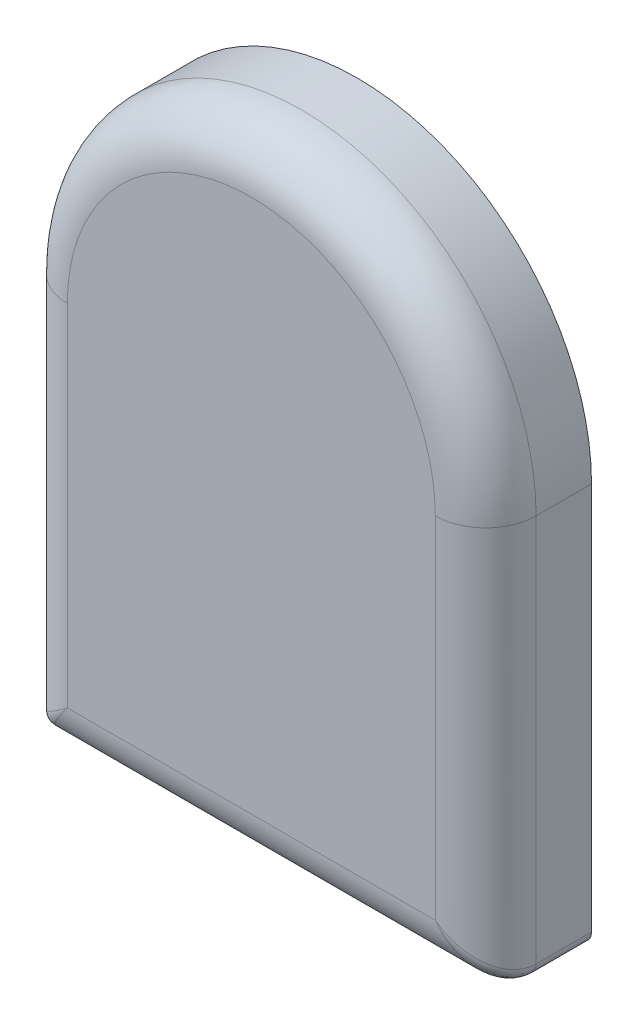
ISO-10303-21;
HEADER;
FILE_DESCRIPTION(('STEP AP214'),'2;1');
FILE_NAME('part.step','',(''),(''),'','','');
FILE_SCHEMA(('AUTOMOTIVE_DESIGN { 1 0 10303 214 1 1 1 1 }'));
ENDSEC;
DATA;
#1=APPLICATION_CONTEXT('core data for automotive mechanical design processes');
#2=APPLICATION_PROTOCOL_DEFINITION('international standard','automotive_design',2000,#1);
#3=PRODUCT_CONTEXT('',#1,'mechanical');
#4=PRODUCT('Part','Part','',(#3));
#5=PRODUCT_RELATED_PRODUCT_CATEGORY('part','',(#4));
#6=PRODUCT_DEFINITION_FORMATION('','',#4);
#7=PRODUCT_DEFINITION_CONTEXT('part definition',#1,'design');
#8=PRODUCT_DEFINITION('design','',#6,#7);
#9=PRODUCT_DEFINITION_SHAPE('','',#8);
#10=(LENGTH_UNIT() NAMED_UNIT(*) SI_UNIT(.MILLI.,.METRE.));
#11=(NAMED_UNIT(*) PLANE_ANGLE_UNIT() SI_UNIT($,.RADIAN.));
#12=(NAMED_UNIT(*) SI_UNIT($,.STERADIAN.) SOLID_ANGLE_UNIT());
#13=UNCERTAINTY_MEASURE_WITH_UNIT(LENGTH_MEASURE(1.E-05),#10,'distance_accuracy_value','');
#14=(GEOMETRIC_REPRESENTATION_CONTEXT(3) GLOBAL_UNCERTAINTY_ASSIGNED_CONTEXT((#13)) GLOBAL_UNIT_ASSIGNED_CONTEXT((#10,
#11,#12)) REPRESENTATION_CONTEXT('',''));
#15=CARTESIAN_POINT('',(0.,0.,0.));
#16=DIRECTION('',(0.,0.,1.));
#17=DIRECTION('',(1.,0.,0.));
#18=AXIS2_PLACEMENT_3D('',#15,#16,#17);
#19=CARTESIAN_POINT('',(8.8,-12.1,4.2));
#20=DIRECTION('',(0.,0.,-1.));
#21=DIRECTION('',(-1.,0.,0.));
#22=AXIS2_PLACEMENT_3D('',#19,#20,#21);
#23=CYLINDRICAL_SURFACE('',#22,0.5);
#24=DIRECTION('',(0.,0.,-1.));
#25=VECTOR('',#24,1.);
#26=CARTESIAN_POINT('',(9.3,-12.1,4.2));
#27=LINE('',#26,#25);
#28=CARTESIAN_POINT('',(9.3,-12.1,2.2));
#29=VERTEX_POINT('',#28);
#30=CARTESIAN_POINT('',(9.3,-12.1,0.));
#31=VERTEX_POINT('',#30);
#32=EDGE_CURVE('E109',#29,#31,#27,.T.);
#33=ORIENTED_EDGE('',*,*,#32,.F.);
#34=CARTESIAN_POINT('',(8.8,-12.1,2.2));
#35=DIRECTION('',(0.,0.,-1.));
#36=DIRECTION('',(-1.,0.,0.));
#37=AXIS2_PLACEMENT_3D('',#34,#35,#36);
#38=CIRCLE('',#37,0.5);
#39=CARTESIAN_POINT('',(8.8,-12.6,2.2));
#40=VERTEX_POINT('',#39);
#41=EDGE_CURVE('E185',#29,#40,#38,.T.);
#42=ORIENTED_EDGE('',*,*,#41,.T.);
#43=DIRECTION('',(0.,0.,-1.));
#44=VECTOR('',#43,1.);
#45=CARTESIAN_POINT('',(8.8,-12.6,4.2));
#46=LINE('',#45,#44);
#47=CARTESIAN_POINT('',(8.8,-12.6,0.));
#48=VERTEX_POINT('',#47);
#49=EDGE_CURVE('E135',#40,#48,#46,.T.);
#50=ORIENTED_EDGE('',*,*,#49,.T.);
#51=CARTESIAN_POINT('',(8.8,-12.1,0.));
#52=DIRECTION('',(0.,0.,1.));
#53=DIRECTION('',(1.,0.,0.));
#54=AXIS2_PLACEMENT_3D('',#51,#52,#53);
#55=CIRCLE('',#54,0.5);
#56=EDGE_CURVE('E128',#48,#31,#55,.T.);
#57=ORIENTED_EDGE('',*,*,#56,.T.);
#58=EDGE_LOOP('',(#33,#42,#50,#57));
#59=FACE_BOUND('',#58,.T.);
#60=ADVANCED_FACE('F43',(#59),#23,.T.);
#61=CARTESIAN_POINT('',(9.3,3.3,4.2));
#62=DIRECTION('',(-1.,0.,0.));
#63=DIRECTION('',(0.,0.,1.));
#64=AXIS2_PLACEMENT_3D('',#61,#62,#63);
#65=PLANE('',#64);
#66=DIRECTION('',(0.,0.,-1.));
#67=VECTOR('',#66,1.);
#68=CARTESIAN_POINT('',(9.3,3.3,4.2));
#69=LINE('',#68,#67);
#70=CARTESIAN_POINT('',(9.3,3.3,2.2));
#71=VERTEX_POINT('',#70);
#72=CARTESIAN_POINT('',(9.3,3.3,0.));
#73=VERTEX_POINT('',#72);
#74=EDGE_CURVE('E122',#71,#73,#69,.T.);
#75=ORIENTED_EDGE('',*,*,#74,.F.);
#76=DIRECTION('',(0.,1.,0.));
#77=VECTOR('',#76,1.);
#78=CARTESIAN_POINT('',(9.3,-12.1,2.2));
#79=LINE('',#78,#77);
#80=EDGE_CURVE('E116',#71,#29,#79,.F.);
#81=ORIENTED_EDGE('',*,*,#80,.T.);
#82=ORIENTED_EDGE('',*,*,#32,.T.);
#83=DIRECTION('',(0.,1.,0.));
#84=VECTOR('',#83,1.);
#85=CARTESIAN_POINT('',(9.3,3.3,0.));
#86=LINE('',#85,#84);
#87=EDGE_CURVE('E113',#31,#73,#86,.T.);
#88=ORIENTED_EDGE('',*,*,#87,.T.);
#89=EDGE_LOOP('',(#75,#81,#82,#88));
#90=FACE_BOUND('',#89,.T.);
#91=ADVANCED_FACE('F112',(#90),#65,.F.);
#92=CARTESIAN_POINT('',(0.,3.3,4.2));
#93=DIRECTION('',(0.,0.,-1.));
#94=DIRECTION('',(-1.,0.,0.));
#95=AXIS2_PLACEMENT_3D('',#92,#93,#94);
#96=CYLINDRICAL_SURFACE('',#95,9.3);
#97=DIRECTION('',(0.,0.,-1.));
#98=VECTOR('',#97,1.);
#99=CARTESIAN_POINT('',(-9.3,3.3,4.2));
#100=LINE('',#99,#98);
#101=CARTESIAN_POINT('',(-9.3,3.3,2.2));
#102=VERTEX_POINT('',#101);
#103=CARTESIAN_POINT('',(-9.3,3.3,0.));
#104=VERTEX_POINT('',#103);
#105=EDGE_CURVE('E164',#102,#104,#100,.T.);
#106=ORIENTED_EDGE('',*,*,#105,.F.);
#107=CARTESIAN_POINT('',(0.,3.3,2.2));
#108=DIRECTION('',(0.,0.,1.));
#109=DIRECTION('',(1.,0.,0.));
#110=AXIS2_PLACEMENT_3D('',#107,#108,#109);
#111=CIRCLE('',#110,9.3);
#112=EDGE_CURVE('E190',#102,#71,#111,.F.);
#113=ORIENTED_EDGE('',*,*,#112,.T.);
#114=ORIENTED_EDGE('',*,*,#74,.T.);
#115=CARTESIAN_POINT('',(0.,3.3,0.));
#116=DIRECTION('',(0.,0.,1.));
#117=DIRECTION('',(1.,0.,0.));
#118=AXIS2_PLACEMENT_3D('',#115,#116,#117);
#119=CIRCLE('',#118,9.3);
#120=EDGE_CURVE('E131',#73,#104,#119,.T.);
#121=ORIENTED_EDGE('',*,*,#120,.T.);
#122=EDGE_LOOP('',(#106,#113,#114,#121));
#123=FACE_BOUND('',#122,.T.);
#124=ADVANCED_FACE('F249',(#123),#96,.T.);
#125=CARTESIAN_POINT('',(-9.3,-12.1,4.2));
#126=DIRECTION('',(1.,0.,0.));
#127=DIRECTION('',(0.,1.,0.));
#128=AXIS2_PLACEMENT_3D('',#125,#126,#127);
#129=PLANE('',#128);
#130=DIRECTION('',(0.,0.,-1.));
#131=VECTOR('',#130,1.);
#132=CARTESIAN_POINT('',(-9.3,-12.1,4.2));
#133=LINE('',#132,#131);
#134=CARTESIAN_POINT('',(-9.3,-12.1,2.2));
#135=VERTEX_POINT('',#134);
#136=CARTESIAN_POINT('',(-9.3,-12.1,0.));
#137=VERTEX_POINT('',#136);
#138=EDGE_CURVE('E161',#135,#137,#133,.T.);
#139=ORIENTED_EDGE('',*,*,#138,.F.);
#140=DIRECTION('',(0.,-1.,0.));
#141=VECTOR('',#140,1.);
#142=CARTESIAN_POINT('',(-9.3,3.3,2.2));
#143=LINE('',#142,#141);
#144=EDGE_CURVE('E53',#135,#102,#143,.F.);
#145=ORIENTED_EDGE('',*,*,#144,.T.);
#146=ORIENTED_EDGE('',*,*,#105,.T.);
#147=DIRECTION('',(0.,-1.,0.));
#148=VECTOR('',#147,1.);
#149=CARTESIAN_POINT('',(-9.3,-12.1,0.));
#150=LINE('',#149,#148);
#151=EDGE_CURVE('E145',#104,#137,#150,.T.);
#152=ORIENTED_EDGE('',*,*,#151,.T.);
#153=EDGE_LOOP('',(#139,#145,#146,#152));
#154=FACE_BOUND('',#153,.T.);
#155=ADVANCED_FACE('F250',(#154),#129,.F.);
#156=CARTESIAN_POINT('',(-8.8,-12.1,4.2));
#157=DIRECTION('',(0.,0.,-1.));
#158=DIRECTION('',(-1.,0.,0.));
#159=AXIS2_PLACEMENT_3D('',#156,#157,#158);
#160=CYLINDRICAL_SURFACE('',#159,0.5);
#161=DIRECTION('',(0.,0.,-1.));
#162=VECTOR('',#161,1.);
#163=CARTESIAN_POINT('',(-8.8,-12.6,4.2));
#164=LINE('',#163,#162);
#165=CARTESIAN_POINT('',(-8.8,-12.6,2.2));
#166=VERTEX_POINT('',#165);
#167=CARTESIAN_POINT('',(-8.8,-12.6,0.));
#168=VERTEX_POINT('',#167);
#169=EDGE_CURVE('E158',#166,#168,#164,.T.);
#170=ORIENTED_EDGE('',*,*,#169,.F.);
#171=CARTESIAN_POINT('',(-8.8,-12.1,2.2));
#172=DIRECTION('',(0.,0.,-1.));
#173=DIRECTION('',(-1.,0.,0.));
#174=AXIS2_PLACEMENT_3D('',#171,#172,#173);
#175=CIRCLE('',#174,0.5);
#176=EDGE_CURVE('E11',#166,#135,#175,.T.);
#177=ORIENTED_EDGE('',*,*,#176,.T.);
#178=ORIENTED_EDGE('',*,*,#138,.T.);
#179=CARTESIAN_POINT('',(-8.8,-12.1,0.));
#180=DIRECTION('',(0.,0.,1.));
#181=DIRECTION('',(1.,0.,0.));
#182=AXIS2_PLACEMENT_3D('',#179,#180,#181);
#183=CIRCLE('',#182,0.5);
#184=EDGE_CURVE('E149',#137,#168,#183,.T.);
#185=ORIENTED_EDGE('',*,*,#184,.T.);
#186=EDGE_LOOP('',(#170,#177,#178,#185));
#187=FACE_BOUND('',#186,.T.);
#188=ADVANCED_FACE('F252',(#187),#160,.T.);
#189=CARTESIAN_POINT('',(8.8,-12.6,4.2));
#190=DIRECTION('',(0.,1.,0.));
#191=DIRECTION('',(0.,0.,1.));
#192=AXIS2_PLACEMENT_3D('',#189,#190,#191);
#193=PLANE('',#192);
#194=ORIENTED_EDGE('',*,*,#49,.F.);
#195=DIRECTION('',(1.,0.,0.));
#196=VECTOR('',#195,1.);
#197=CARTESIAN_POINT('',(-8.8,-12.6,2.2));
#198=LINE('',#197,#196);
#199=EDGE_CURVE('E181',#40,#166,#198,.F.);
#200=ORIENTED_EDGE('',*,*,#199,.T.);
#201=ORIENTED_EDGE('',*,*,#169,.T.);
#202=DIRECTION('',(1.,0.,0.));
#203=VECTOR('',#202,1.);
#204=CARTESIAN_POINT('',(8.8,-12.6,0.));
#205=LINE('',#204,#203);
#206=EDGE_CURVE('E153',#168,#48,#205,.T.);
#207=ORIENTED_EDGE('',*,*,#206,.T.);
#208=EDGE_LOOP('',(#194,#200,#201,#207));
#209=FACE_BOUND('',#208,.T.);
#210=ADVANCED_FACE('F254',(#209),#193,.F.);
#211=CARTESIAN_POINT('',(8.8,-12.1,4.2));
#212=DIRECTION('',(0.,0.,1.));
#213=DIRECTION('',(1.,0.,0.));
#214=AXIS2_PLACEMENT_3D('',#211,#212,#213);
#215=PLANE('',#214);
#216=DIRECTION('',(0.,-1.,0.));
#217=VECTOR('',#216,1.);
#218=CARTESIAN_POINT('',(-7.3,-12.1,4.2));
#219=LINE('',#218,#217);
#220=CARTESIAN_POINT('',(-7.3,3.3,4.2));
#221=VERTEX_POINT('',#220);
#222=CARTESIAN_POINT('',(-7.3,-10.6,4.2));
#223=VERTEX_POINT('',#222);
#224=EDGE_CURVE('E121',#221,#223,#219,.T.);
#225=ORIENTED_EDGE('',*,*,#224,.T.);
#226=DIRECTION('',(1.,0.,0.));
#227=VECTOR('',#226,1.);
#228=CARTESIAN_POINT('',(8.8,-10.6,4.2));
#229=LINE('',#228,#227);
#230=CARTESIAN_POINT('',(7.3,-10.6,4.2));
#231=VERTEX_POINT('',#230);
#232=EDGE_CURVE('E177',#223,#231,#229,.T.);
#233=ORIENTED_EDGE('',*,*,#232,.T.);
#234=DIRECTION('',(0.,1.,0.));
#235=VECTOR('',#234,1.);
#236=CARTESIAN_POINT('',(7.3,3.3,4.2));
#237=LINE('',#236,#235);
#238=CARTESIAN_POINT('',(7.3,3.3,4.2));
#239=VERTEX_POINT('',#238);
#240=EDGE_CURVE('E174',#231,#239,#237,.T.);
#241=ORIENTED_EDGE('',*,*,#240,.T.);
#242=CARTESIAN_POINT('',(0.,3.3,4.2));
#243=DIRECTION('',(0.,0.,1.));
#244=DIRECTION('',(1.,0.,0.));
#245=AXIS2_PLACEMENT_3D('',#242,#243,#244);
#246=CIRCLE('',#245,7.3);
#247=EDGE_CURVE('E171',#239,#221,#246,.T.);
#248=ORIENTED_EDGE('',*,*,#247,.T.);
#249=EDGE_LOOP('',(#225,#233,#241,#248));
#250=FACE_BOUND('',#249,.T.);
#251=ADVANCED_FACE('F260',(#250),#215,.T.);
#252=CARTESIAN_POINT('',(8.8,-12.1,0.));
#253=DIRECTION('',(0.,0.,1.));
#254=DIRECTION('',(1.,0.,0.));
#255=AXIS2_PLACEMENT_3D('',#252,#253,#254);
#256=PLANE('',#255);
#257=ORIENTED_EDGE('',*,*,#56,.F.);
#258=ORIENTED_EDGE('',*,*,#206,.F.);
#259=ORIENTED_EDGE('',*,*,#184,.F.);
#260=ORIENTED_EDGE('',*,*,#151,.F.);
#261=ORIENTED_EDGE('',*,*,#120,.F.);
#262=ORIENTED_EDGE('',*,*,#87,.F.);
#263=EDGE_LOOP('',(#257,#258,#259,#260,#261,#262));
#264=FACE_BOUND('',#263,.T.);
#265=ADVANCED_FACE('F126',(#264),#256,.F.);
#266=CARTESIAN_POINT('',(0.,3.3,2.2));
#267=DIRECTION('',(0.,0.,1.));
#268=DIRECTION('',(1.,0.,0.));
#269=AXIS2_PLACEMENT_3D('',#266,#267,#268);
#270=TOROIDAL_SURFACE('',#269,7.3,2.);
#271=CARTESIAN_POINT('',(7.3,3.3,2.2));
#272=DIRECTION('',(0.,-1.,0.));
#273=DIRECTION('',(0.,0.,-1.));
#274=AXIS2_PLACEMENT_3D('',#271,#272,#273);
#275=CIRCLE('',#274,2.);
#276=EDGE_CURVE('E141',#71,#239,#275,.T.);
#277=ORIENTED_EDGE('',*,*,#276,.F.);
#278=ORIENTED_EDGE('',*,*,#112,.F.);
#279=CARTESIAN_POINT('',(-7.3,3.3,2.2));
#280=DIRECTION('',(0.,-1.,0.));
#281=DIRECTION('',(1.,0.,0.));
#282=AXIS2_PLACEMENT_3D('',#279,#280,#281);
#283=CIRCLE('',#282,2.);
#284=EDGE_CURVE('E47',#221,#102,#283,.T.);
#285=ORIENTED_EDGE('',*,*,#284,.F.);
#286=ORIENTED_EDGE('',*,*,#247,.F.);
#287=EDGE_LOOP('',(#277,#278,#285,#286));
#288=FACE_BOUND('',#287,.T.);
#289=ADVANCED_FACE('F45',(#288),#270,.T.);
#290=CARTESIAN_POINT('',(-7.3,-12.1,2.2));
#291=DIRECTION('',(0.,1.,0.));
#292=DIRECTION('',(-1.,0.,0.));
#293=AXIS2_PLACEMENT_3D('',#290,#291,#292);
#294=CYLINDRICAL_SURFACE('',#293,2.);
#295=ORIENTED_EDGE('',*,*,#284,.T.);
#296=ORIENTED_EDGE('',*,*,#144,.F.);
#297=CARTESIAN_POINT('',(-7.3,-10.6,2.2));
#298=DIRECTION('',(0.6,-0.8,0.));
#299=DIRECTION('',(-0.8,-0.6,0.));
#300=AXIS2_PLACEMENT_3D('',#297,#298,#299);
#301=ELLIPSE('',#300,2.5,2.);
#302=EDGE_CURVE('E205',#223,#135,#301,.T.);
#303=ORIENTED_EDGE('',*,*,#302,.F.);
#304=ORIENTED_EDGE('',*,*,#224,.F.);
#305=EDGE_LOOP('',(#295,#296,#303,#304));
#306=FACE_BOUND('',#305,.T.);
#307=ADVANCED_FACE('F225',(#306),#294,.T.);
#308=CARTESIAN_POINT('',(7.3,-12.1,2.2));
#309=DIRECTION('',(0.,-1.,0.));
#310=DIRECTION('',(0.,0.,-1.));
#311=AXIS2_PLACEMENT_3D('',#308,#309,#310);
#312=CYLINDRICAL_SURFACE('',#311,2.);
#313=ORIENTED_EDGE('',*,*,#276,.T.);
#314=ORIENTED_EDGE('',*,*,#240,.F.);
#315=CARTESIAN_POINT('',(7.3,-10.6,2.2));
#316=DIRECTION('',(0.6,0.8,0.));
#317=DIRECTION('',(0.8,-0.6,0.));
#318=AXIS2_PLACEMENT_3D('',#315,#316,#317);
#319=ELLIPSE('',#318,2.5,2.);
#320=EDGE_CURVE('E201',#29,#231,#319,.F.);
#321=ORIENTED_EDGE('',*,*,#320,.F.);
#322=ORIENTED_EDGE('',*,*,#80,.F.);
#323=EDGE_LOOP('',(#313,#314,#321,#322));
#324=FACE_BOUND('',#323,.T.);
#325=ADVANCED_FACE('F221',(#324),#312,.T.);
#326=CARTESIAN_POINT('',(-7.3,-10.6,0.200000000000001));
#327=CARTESIAN_POINT('',(-7.3,-10.6,0.200000000000001));
#328=CARTESIAN_POINT('',(-7.3,-10.6,0.200000000000001));
#329=CARTESIAN_POINT('',(-7.36534712065569,-10.6871294942076,0.200035055250015));
#330=CARTESIAN_POINT('',(-7.37625301968526,-10.6762530196853,0.199976339095898));
#331=CARTESIAN_POINT('',(-7.38712949420759,-10.6653471206557,0.200035055250015));
#332=CARTESIAN_POINT('',(-7.43071092668624,-10.7742812355817,0.205696487430835));
#333=CARTESIAN_POINT('',(-7.45271669848803,-10.752716698488,0.204277360821934));
#334=CARTESIAN_POINT('',(-7.47428123558166,-10.7307109266862,0.205696487430835));
#335=CARTESIAN_POINT('',(-7.56031449090428,-10.9470859878724,0.228427051088899));
#336=CARTESIAN_POINT('',(-7.60446975212246,-10.9044697521225,0.22140059823371));
#337=CARTESIAN_POINT('',(-7.64708598787237,-10.8603144909043,0.228427051088899));
#338=CARTESIAN_POINT('',(-7.62455908096206,-11.0327454412827,0.245398809321809));
#339=CARTESIAN_POINT('',(-7.68019165762918,-10.9801916576292,0.234247025705178));
#340=CARTESIAN_POINT('',(-7.73274544128274,-10.9245590809621,0.245398809321809));
#341=CARTESIAN_POINT('',(-7.75083012894728,-11.2011068385964,0.290516308556291));
#342=CARTESIAN_POINT('',(-7.82973753195478,-11.1297375319548,0.268479521630331));
#343=CARTESIAN_POINT('',(-7.90110683859638,-11.0508301289473,0.290516308556291));
#344=CARTESIAN_POINT('',(-7.81287571744484,-11.2838342899265,0.318469854155509));
#345=CARTESIAN_POINT('',(-7.90398851452828,-11.2039885145283,0.289912895749702));
#346=CARTESIAN_POINT('',(-7.98383428992645,-11.1128757174448,0.318469854155509));
#347=CARTESIAN_POINT('',(-7.93366820048003,-11.4448909339734,0.385180085693134));
#348=CARTESIAN_POINT('',(-8.04991425185414,-11.3499142518541,0.341360606992456));
#349=CARTESIAN_POINT('',(-8.14489093397337,-11.23366820048,0.385180085693134));
#350=CARTESIAN_POINT('',(-7.99245870376998,-11.5232782716933,0.423653679114348));
#351=CARTESIAN_POINT('',(-8.12200143121126,-11.4220014312113,0.371441966476322));
#352=CARTESIAN_POINT('',(-8.22327827169331,-11.29245870377,0.423653679114348));
#353=CARTESIAN_POINT('',(-8.10570975300993,-11.6742796706799,0.510834776663723));
#354=CARTESIAN_POINT('',(-8.26295325731846,-11.5629532573185,0.440367062406523));
#355=CARTESIAN_POINT('',(-8.3742796706799,-11.4057097530099,0.510834776663724));
#356=CARTESIAN_POINT('',(-8.1602485580067,-11.7469980773423,0.559177555106217));
#357=CARTESIAN_POINT('',(-8.33220337416109,-11.6322033741611,0.479288917524901));
#358=CARTESIAN_POINT('',(-8.44699807734226,-11.4602485580067,0.559177555106218));
#359=CARTESIAN_POINT('',(-8.26402611496821,-11.8853681532909,0.665353034789945));
#360=CARTESIAN_POINT('',(-8.46682192510474,-11.7668219251047,0.566297856684954));
#361=CARTESIAN_POINT('',(-8.58536815329094,-11.5640261149682,0.665353034789946));
#362=CARTESIAN_POINT('',(-8.31338750743845,-11.9511833432513,0.722755397155792));
#363=CARTESIAN_POINT('',(-8.53252990498461,-11.8325299049846,0.614455680376174));
#364=CARTESIAN_POINT('',(-8.65118334325127,-11.6133875074385,0.722755397155792));
#365=CARTESIAN_POINT('',(-8.40591892041319,-12.0745585605509,0.846132222162794));
#366=CARTESIAN_POINT('',(-8.65927843911775,-11.9592784391177,0.72064706325371));
#367=CARTESIAN_POINT('',(-8.77455856055092,-11.7059189204132,0.846132222162793));
#368=CARTESIAN_POINT('',(-8.44926311849199,-12.132350824656,0.911637313282867));
#369=CARTESIAN_POINT('',(-8.72058796060971,-12.0205879606097,0.77870927589382));
#370=CARTESIAN_POINT('',(-8.83235082465598,-11.749263118492,0.911637313282867));
#371=CARTESIAN_POINT('',(-8.52896450999682,-12.2386193466624,1.05013285836796));
#372=CARTESIAN_POINT('',(-8.83742230607737,-12.1374223060774,0.905718655842486));
#373=CARTESIAN_POINT('',(-8.93861934666242,-11.8289645099968,1.05013285836796));
#374=CARTESIAN_POINT('',(-8.56554818620167,-12.2873975816022,1.12265451812362));
#375=CARTESIAN_POINT('',(-8.893119014594,-12.193119014594,0.974594782404193));
#376=CARTESIAN_POINT('',(-8.98739758160222,-11.8655481862017,1.12265451812362));
#377=CARTESIAN_POINT('',(-8.63104897214961,-12.3747319628661,1.27392958631864));
#378=CARTESIAN_POINT('',(-8.99700237456934,-12.2970023745693,1.12428825163707));
#379=CARTESIAN_POINT('',(-9.07473196286614,-11.9310489721496,1.27392958631864));
#380=CARTESIAN_POINT('',(-8.66023331373321,-12.4136444183109,1.35226632370846));
#381=CARTESIAN_POINT('',(-9.04524564728287,-12.3452456472829,1.20485256451251));
#382=CARTESIAN_POINT('',(-9.11364441831094,-11.9602333137332,1.35226632370846));
#383=CARTESIAN_POINT('',(-8.71039789563343,-12.4805305275112,1.51375694675793));
#384=CARTESIAN_POINT('',(-9.13168487740083,-12.4316848774008,1.37835057694996));
#385=CARTESIAN_POINT('',(-9.18053052751125,-12.0103978956334,1.51375694675793));
#386=CARTESIAN_POINT('',(-8.73165591145982,-12.5088745486131,1.59659973042092));
#387=CARTESIAN_POINT('',(-9.16982930810949,-12.4698293081095,1.47075659896622));
#388=CARTESIAN_POINT('',(-9.20887454861309,-12.0316559114598,1.59659973042092));
#389=CARTESIAN_POINT('',(-8.76560412617006,-12.5541388348934,1.76554895244281));
#390=CARTESIAN_POINT('',(-9.23291592445389,-12.5329159244539,1.6666663568643));
#391=CARTESIAN_POINT('',(-9.25413883489341,-12.0656041261701,1.76554895244281));
#392=CARTESIAN_POINT('',(-8.7785324204649,-12.5713765606199,1.85148270452044));
#393=CARTESIAN_POINT('',(-9.25774658379329,-12.5577465837933,1.76930869505542));
#394=CARTESIAN_POINT('',(-9.27137656061987,-12.0785324204649,1.85148270452044));
#395=CARTESIAN_POINT('',(-8.79566049473916,-12.5942139929855,2.0249775244552));
#396=CARTESIAN_POINT('',(-9.29133353940984,-12.5913335394098,1.98185786072974));
#397=CARTESIAN_POINT('',(-9.29421399298555,-12.0956604947392,2.0249775244552));
#398=CARTESIAN_POINT('',(-8.8,-12.6,2.1124887622276));
#399=CARTESIAN_POINT('',(-9.3,-12.6,2.0906106505444));
#400=CARTESIAN_POINT('',(-9.3,-12.1,2.1124887622276));
#401=CARTESIAN_POINT('',(-8.8,-12.6,2.2875112377724));
#402=CARTESIAN_POINT('',(-9.3,-12.6,2.30938934945561));
#403=CARTESIAN_POINT('',(-9.3,-12.1,2.2875112377724));
#404=CARTESIAN_POINT('',(-8.79566049473916,-12.5942139929855,2.37502247554481));
#405=CARTESIAN_POINT('',(-9.29133353940984,-12.5913335394098,2.41814213927026));
#406=CARTESIAN_POINT('',(-9.29421399298555,-12.0956604947392,2.37502247554481));
#407=CARTESIAN_POINT('',(-8.7785324204649,-12.5713765606199,2.54851729547956));
#408=CARTESIAN_POINT('',(-9.25774658379329,-12.5577465837933,2.63069130494458));
#409=CARTESIAN_POINT('',(-9.27137656061987,-12.0785324204649,2.54851729547956));
#410=CARTESIAN_POINT('',(-8.76560412617006,-12.5541388348934,2.63445104755719));
#411=CARTESIAN_POINT('',(-9.23291592445389,-12.5329159244539,2.7333336431357));
#412=CARTESIAN_POINT('',(-9.25413883489341,-12.0656041261701,2.63445104755719));
#413=CARTESIAN_POINT('',(-8.73165591145982,-12.5088745486131,2.80340026957908));
#414=CARTESIAN_POINT('',(-9.16982930810949,-12.4698293081095,2.92924340103378));
#415=CARTESIAN_POINT('',(-9.20887454861309,-12.0316559114598,2.80340026957908));
#416=CARTESIAN_POINT('',(-8.71039789563343,-12.4805305275113,2.88624305324207));
#417=CARTESIAN_POINT('',(-9.13168487740083,-12.4316848774008,3.02164942305004));
#418=CARTESIAN_POINT('',(-9.18053052751125,-12.0103978956334,2.88624305324207));
#419=CARTESIAN_POINT('',(-8.66023331373321,-12.4136444183109,3.04773367629154));
#420=CARTESIAN_POINT('',(-9.04524564728287,-12.3452456472829,3.19514743548749));
#421=CARTESIAN_POINT('',(-9.11364441831094,-11.9602333137332,3.04773367629154));
#422=CARTESIAN_POINT('',(-8.63104897214961,-12.3747319628661,3.12607041368136));
#423=CARTESIAN_POINT('',(-8.99700237456934,-12.2970023745693,3.27571174836293));
#424=CARTESIAN_POINT('',(-9.07473196286614,-11.9310489721496,3.12607041368136));
#425=CARTESIAN_POINT('',(-8.56554818620167,-12.2873975816022,3.27734548187638));
#426=CARTESIAN_POINT('',(-8.893119014594,-12.193119014594,3.42540521759581));
#427=CARTESIAN_POINT('',(-8.98739758160222,-11.8655481862017,3.27734548187638));
#428=CARTESIAN_POINT('',(-8.52896450999682,-12.2386193466624,3.34986714163205));
#429=CARTESIAN_POINT('',(-8.83742230607737,-12.1374223060774,3.49428134415751));
#430=CARTESIAN_POINT('',(-8.93861934666242,-11.8289645099968,3.34986714163205));
#431=CARTESIAN_POINT('',(-8.44926311849199,-12.132350824656,3.48836268671713));
#432=CARTESIAN_POINT('',(-8.72058796060971,-12.0205879606097,3.62129072410618));
#433=CARTESIAN_POINT('',(-8.83235082465598,-11.749263118492,3.48836268671713));
#434=CARTESIAN_POINT('',(-8.40591892041319,-12.0745585605509,3.55386777783721));
#435=CARTESIAN_POINT('',(-8.65927843911775,-11.9592784391177,3.67935293674629));
#436=CARTESIAN_POINT('',(-8.77455856055092,-11.7059189204132,3.55386777783721));
#437=CARTESIAN_POINT('',(-8.31338750743845,-11.9511833432513,3.67724460284421));
#438=CARTESIAN_POINT('',(-8.53252990498461,-11.8325299049846,3.78554431962383));
#439=CARTESIAN_POINT('',(-8.65118334325127,-11.6133875074385,3.67724460284421));
#440=CARTESIAN_POINT('',(-8.26402611496821,-11.8853681532909,3.73464696521006));
#441=CARTESIAN_POINT('',(-8.46682192510474,-11.7668219251047,3.83370214331505));
#442=CARTESIAN_POINT('',(-8.58536815329094,-11.5640261149682,3.73464696521006));
#443=CARTESIAN_POINT('',(-8.1602485580067,-11.7469980773423,3.84082244489378));
#444=CARTESIAN_POINT('',(-8.33220337416109,-11.6322033741611,3.9207110824751));
#445=CARTESIAN_POINT('',(-8.44699807734226,-11.4602485580067,3.84082244489378));
#446=CARTESIAN_POINT('',(-8.10570975300993,-11.6742796706799,3.88916522333628));
#447=CARTESIAN_POINT('',(-8.26295325731846,-11.5629532573185,3.95963293759348));
#448=CARTESIAN_POINT('',(-8.3742796706799,-11.4057097530099,3.88916522333628));
#449=CARTESIAN_POINT('',(-7.99245870376998,-11.5232782716933,3.97634632088565));
#450=CARTESIAN_POINT('',(-8.12200143121126,-11.4220014312113,4.02855803352368));
#451=CARTESIAN_POINT('',(-8.22327827169331,-11.29245870377,3.97634632088565));
#452=CARTESIAN_POINT('',(-7.93366820048003,-11.4448909339734,4.01481991430687));
#453=CARTESIAN_POINT('',(-8.04991425185414,-11.3499142518541,4.05863939300755));
#454=CARTESIAN_POINT('',(-8.14489093397337,-11.23366820048,4.01481991430687));
#455=CARTESIAN_POINT('',(-7.81287571744484,-11.2838342899265,4.08153014584449));
#456=CARTESIAN_POINT('',(-7.90398851452829,-11.2039885145283,4.1100871042503));
#457=CARTESIAN_POINT('',(-7.98383428992646,-11.1128757174448,4.08153014584449));
#458=CARTESIAN_POINT('',(-7.75083012894728,-11.2011068385964,4.10948369144371));
#459=CARTESIAN_POINT('',(-7.82973753195478,-11.1297375319548,4.13152047836967));
#460=CARTESIAN_POINT('',(-7.90110683859638,-11.0508301289473,4.10948369144371));
#461=CARTESIAN_POINT('',(-7.62455908096206,-11.0327454412827,4.15460119067819));
#462=CARTESIAN_POINT('',(-7.68019165762918,-10.9801916576292,4.16575297429482));
#463=CARTESIAN_POINT('',(-7.73274544128274,-10.9245590809621,4.15460119067819));
#464=CARTESIAN_POINT('',(-7.56031449090428,-10.9470859878724,4.1715729489111));
#465=CARTESIAN_POINT('',(-7.60446975212246,-10.9044697521225,4.17859940176629));
#466=CARTESIAN_POINT('',(-7.64708598787237,-10.8603144909043,4.1715729489111));
#467=CARTESIAN_POINT('',(-7.43071092668624,-10.7742812355817,4.19430351256917));
#468=CARTESIAN_POINT('',(-7.45271669848803,-10.752716698488,4.19572263917807));
#469=CARTESIAN_POINT('',(-7.47428123558166,-10.7307109266862,4.19430351256917));
#470=CARTESIAN_POINT('',(-7.3653471206557,-10.6871294942076,4.19996494474999));
#471=CARTESIAN_POINT('',(-7.37625301968526,-10.6762530196853,4.2000236609041));
#472=CARTESIAN_POINT('',(-7.38712949420759,-10.6653471206557,4.19996494474999));
#473=CARTESIAN_POINT('',(-7.3,-10.6,4.2));
#474=CARTESIAN_POINT('',(-7.3,-10.6,4.2));
#475=CARTESIAN_POINT('',(-7.3,-10.6,4.2));
#476=(BOUNDED_SURFACE() B_SPLINE_SURFACE(3,2,((#326,#327,#328),(#329,#330,#331),(#332,#333,
#334),(#335,#336,#337),(#338,#339,#340),(#341,#342,#343),(#344,#345,#346),(#347,#348,#349),
(#350,#351,#352),(#353,#354,#355),(#356,#357,#358),(#359,#360,#361),(#362,#363,#364),(#365,#366,
#367),(#368,#369,#370),(#371,#372,#373),(#374,#375,#376),(#377,#378,#379),(#380,#381,#382),
(#383,#384,#385),(#386,#387,#388),(#389,#390,#391),(#392,#393,#394),(#395,#396,#397),(#398,#399,
#400),(#401,#402,#403),(#404,#405,#406),(#407,#408,#409),(#410,#411,#412),(#413,#414,#415),
(#416,#417,#418),(#419,#420,#421),(#422,#423,#424),(#425,#426,#427),(#428,#429,#430),(#431,#432,
#433),(#434,#435,#436),(#437,#438,#439),(#440,#441,#442),(#443,#444,#445),(#446,#447,#448),
(#449,#450,#451),(#452,#453,#454),(#455,#456,#457),(#458,#459,#460),(#461,#462,#463),(#464,#465,
#466),(#467,#468,#469),(#470,#471,#472),(#473,#474,#475)),.UNSPECIFIED.,.F.,.F.,
.F.) B_SPLINE_SURFACE_WITH_KNOTS((4,2,2,2,2,2,2,2,2,2,2,2,2,2,2,2,2,2,2,2,2,2,2,2,4),(3,3),(0.,
0.277185081205051,0.552014119053092,0.822233461976019,1.08579611517548,1.34096955189626,
1.58644804888033,1.82146864153553,2.04592551633704,2.26046944958155,2.4665662185127,
2.66647462606246,2.86310321556792,3.05973180507339,3.25964021262314,3.46573698155429,
3.6802809147988,3.90473778960032,4.13975838225551,4.38523687923959,4.64041031596037,
4.90397296915983,5.17419231208275,5.44902134993079,5.72620643113585),(0.,1.),
.UNSPECIFIED.) GEOMETRIC_REPRESENTATION_ITEM() RATIONAL_B_SPLINE_SURFACE(((1.,1.,1.),(1.,
1.00000566557019,1.),(1.,0.998576699090688,1.),(1.,0.992910721279765,1.),(1.,0.988697681267574,
1.),(1.,0.97761712883305,1.),(1.,0.970795325018433,1.),(1.,0.954789124900482,1.),(1.,
0.945667069465631,1.),(1.,0.92548796875733,1.),(1.,0.914501756375306,1.),(1.,0.891169998194024,
1.),(1.,0.878891956959708,1.),(1.,0.853706993048538,1.),(1.,0.84084914596985,1.),(1.,
0.815387454422431,1.),(1.,0.802798170091792,1.),(1.,0.778880732263429,1.),(1.,0.767521437046521,
1.),(1.,0.747118526989836,1.),(1.,0.738001346912332,1.),(1.,0.723039691293395,1.),(1.,
0.717105167896984,1.),(1.,0.709170186451793,1.),(1.,0.707106781186548,1.),(1.,0.707106781186548,
1.),(1.,0.709170186451793,1.),(1.,0.717105167896984,1.),(1.,0.723039691293395,1.),(1.,
0.738001346912332,1.),(1.,0.747118526989835,1.),(1.,0.767521437046521,1.),(1.,0.778880732263429,
1.),(1.,0.802798170091792,1.),(1.,0.815387454422431,1.),(1.,0.84084914596985,1.),(1.,
0.853706993048538,1.),(1.,0.878891956959708,1.),(1.,0.891169998194024,1.),(1.,0.914501756375306,
1.),(1.,0.92548796875733,1.),(1.,0.945667069465631,1.),(1.,0.954789124900482,1.),(1.,
0.970795325018433,1.),(1.,0.97761712883305,1.),(1.,0.988697681267574,1.),(1.,0.992910721279765,
1.),(1.,0.998576699090688,1.),(1.,1.00000566557019,1.),(1.,1.,1.))) REPRESENTATION_ITEM('') SURFACE());
#477=ORIENTED_EDGE('',*,*,#302,.T.);
#478=ORIENTED_EDGE('',*,*,#176,.F.);
#479=CARTESIAN_POINT('',(-7.3,-10.6,2.2));
#480=DIRECTION('',(0.8,-0.6,0.));
#481=DIRECTION('',(-0.6,-0.8,0.));
#482=AXIS2_PLACEMENT_3D('',#479,#480,#481);
#483=ELLIPSE('',#482,2.5,2.);
#484=EDGE_CURVE('E198',#223,#166,#483,.T.);
#485=ORIENTED_EDGE('',*,*,#484,.F.);
#486=EDGE_LOOP('',(#477,#478,#485));
#487=FACE_BOUND('',#486,.T.);
#488=ADVANCED_FACE('F217',(#487),#476,.T.);
#489=CARTESIAN_POINT('',(7.3,-10.6,0.200000000000001));
#490=CARTESIAN_POINT('',(7.3,-10.6,0.200000000000001));
#491=CARTESIAN_POINT('',(7.3,-10.6,0.200000000000001));
#492=CARTESIAN_POINT('',(7.38712949420759,-10.6653471206557,0.200035055250015));
#493=CARTESIAN_POINT('',(7.37625301968526,-10.6762530196853,0.199976339095899));
#494=CARTESIAN_POINT('',(7.3653471206557,-10.6871294942076,0.200035055250015));
#495=CARTESIAN_POINT('',(7.47428123558166,-10.7307109266862,0.205696487430835));
#496=CARTESIAN_POINT('',(7.45271669848803,-10.752716698488,0.204277360821935));
#497=CARTESIAN_POINT('',(7.43071092668625,-10.7742812355817,0.205696487430835));
#498=CARTESIAN_POINT('',(7.64708598787237,-10.8603144909043,0.228427051088899));
#499=CARTESIAN_POINT('',(7.60446975212246,-10.9044697521225,0.22140059823371));
#500=CARTESIAN_POINT('',(7.56031449090428,-10.9470859878724,0.228427051088899));
#501=CARTESIAN_POINT('',(7.73274544128274,-10.9245590809621,0.245398809321809));
#502=CARTESIAN_POINT('',(7.68019165762918,-10.9801916576292,0.234247025705178));
#503=CARTESIAN_POINT('',(7.62455908096206,-11.0327454412827,0.245398809321809));
#504=CARTESIAN_POINT('',(7.90110683859638,-11.0508301289473,0.290516308556291));
#505=CARTESIAN_POINT('',(7.82973753195478,-11.1297375319548,0.268479521630331));
#506=CARTESIAN_POINT('',(7.75083012894728,-11.2011068385964,0.290516308556291));
#507=CARTESIAN_POINT('',(7.98383428992646,-11.1128757174448,0.318469854155509));
#508=CARTESIAN_POINT('',(7.90398851452829,-11.2039885145283,0.289912895749702));
#509=CARTESIAN_POINT('',(7.81287571744484,-11.2838342899265,0.318469854155509));
#510=CARTESIAN_POINT('',(8.14489093397337,-11.23366820048,0.385180085693134));
#511=CARTESIAN_POINT('',(8.04991425185414,-11.3499142518541,0.341360606992456));
#512=CARTESIAN_POINT('',(7.93366820048003,-11.4448909339734,0.385180085693134));
#513=CARTESIAN_POINT('',(8.22327827169331,-11.29245870377,0.423653679114348));
#514=CARTESIAN_POINT('',(8.12200143121127,-11.4220014312113,0.371441966476322));
#515=CARTESIAN_POINT('',(7.99245870376998,-11.5232782716933,0.423653679114348));
#516=CARTESIAN_POINT('',(8.3742796706799,-11.4057097530099,0.510834776663724));
#517=CARTESIAN_POINT('',(8.26295325731846,-11.5629532573185,0.440367062406523));
#518=CARTESIAN_POINT('',(8.10570975300993,-11.6742796706799,0.510834776663724));
#519=CARTESIAN_POINT('',(8.44699807734226,-11.4602485580067,0.559177555106217));
#520=CARTESIAN_POINT('',(8.33220337416109,-11.6322033741611,0.479288917524901));
#521=CARTESIAN_POINT('',(8.1602485580067,-11.7469980773423,0.559177555106217));
#522=CARTESIAN_POINT('',(8.58536815329094,-11.5640261149682,0.665353034789945));
#523=CARTESIAN_POINT('',(8.46682192510474,-11.7668219251047,0.566297856684954));
#524=CARTESIAN_POINT('',(8.26402611496821,-11.8853681532909,0.665353034789945));
#525=CARTESIAN_POINT('',(8.65118334325127,-11.6133875074385,0.722755397155792));
#526=CARTESIAN_POINT('',(8.53252990498461,-11.8325299049846,0.614455680376174));
#527=CARTESIAN_POINT('',(8.31338750743845,-11.9511833432513,0.722755397155792));
#528=CARTESIAN_POINT('',(8.77455856055092,-11.7059189204132,0.846132222162794));
#529=CARTESIAN_POINT('',(8.65927843911775,-11.9592784391178,0.72064706325371));
#530=CARTESIAN_POINT('',(8.40591892041319,-12.0745585605509,0.846132222162794));
#531=CARTESIAN_POINT('',(8.83235082465598,-11.749263118492,0.911637313282867));
#532=CARTESIAN_POINT('',(8.72058796060972,-12.0205879606097,0.77870927589382));
#533=CARTESIAN_POINT('',(8.44926311849199,-12.132350824656,0.911637313282867));
#534=CARTESIAN_POINT('',(8.93861934666242,-11.8289645099968,1.05013285836796));
#535=CARTESIAN_POINT('',(8.83742230607737,-12.1374223060774,0.905718655842486));
#536=CARTESIAN_POINT('',(8.52896450999682,-12.2386193466624,1.05013285836796));
#537=CARTESIAN_POINT('',(8.98739758160223,-11.8655481862017,1.12265451812362));
#538=CARTESIAN_POINT('',(8.893119014594,-12.193119014594,0.974594782404194));
#539=CARTESIAN_POINT('',(8.56554818620167,-12.2873975816022,1.12265451812362));
#540=CARTESIAN_POINT('',(9.07473196286614,-11.9310489721496,1.27392958631864));
#541=CARTESIAN_POINT('',(8.99700237456934,-12.2970023745693,1.12428825163707));
#542=CARTESIAN_POINT('',(8.63104897214961,-12.3747319628661,1.27392958631864));
#543=CARTESIAN_POINT('',(9.11364441831095,-11.9602333137332,1.35226632370846));
#544=CARTESIAN_POINT('',(9.04524564728287,-12.3452456472829,1.20485256451251));
#545=CARTESIAN_POINT('',(8.66023331373321,-12.4136444183109,1.35226632370846));
#546=CARTESIAN_POINT('',(9.18053052751125,-12.0103978956334,1.51375694675793));
#547=CARTESIAN_POINT('',(9.13168487740083,-12.4316848774008,1.37835057694997));
#548=CARTESIAN_POINT('',(8.71039789563344,-12.4805305275112,1.51375694675793));
#549=CARTESIAN_POINT('',(9.2088745486131,-12.0316559114598,1.59659973042092));
#550=CARTESIAN_POINT('',(9.16982930810949,-12.4698293081095,1.47075659896622));
#551=CARTESIAN_POINT('',(8.73165591145982,-12.5088745486131,1.59659973042092));
#552=CARTESIAN_POINT('',(9.25413883489341,-12.0656041261701,1.76554895244281));
#553=CARTESIAN_POINT('',(9.23291592445389,-12.5329159244539,1.6666663568643));
#554=CARTESIAN_POINT('',(8.76560412617006,-12.5541388348934,1.76554895244281));
#555=CARTESIAN_POINT('',(9.27137656061987,-12.0785324204649,1.85148270452044));
#556=CARTESIAN_POINT('',(9.25774658379329,-12.5577465837933,1.76930869505542));
#557=CARTESIAN_POINT('',(8.77853242046491,-12.5713765606199,1.85148270452044));
#558=CARTESIAN_POINT('',(9.29421399298555,-12.0956604947392,2.0249775244552));
#559=CARTESIAN_POINT('',(9.29133353940984,-12.5913335394098,1.98185786072974));
#560=CARTESIAN_POINT('',(8.79566049473916,-12.5942139929855,2.0249775244552));
#561=CARTESIAN_POINT('',(9.3,-12.1,2.1124887622276));
#562=CARTESIAN_POINT('',(9.3,-12.6,2.0906106505444));
#563=CARTESIAN_POINT('',(8.8,-12.6,2.1124887622276));
#564=CARTESIAN_POINT('',(9.3,-12.1,2.2875112377724));
#565=CARTESIAN_POINT('',(9.3,-12.6,2.30938934945561));
#566=CARTESIAN_POINT('',(8.8,-12.6,2.2875112377724));
#567=CARTESIAN_POINT('',(9.29421399298555,-12.0956604947392,2.37502247554481));
#568=CARTESIAN_POINT('',(9.29133353940984,-12.5913335394098,2.41814213927026));
#569=CARTESIAN_POINT('',(8.79566049473916,-12.5942139929855,2.37502247554481));
#570=CARTESIAN_POINT('',(9.27137656061987,-12.0785324204649,2.54851729547956));
#571=CARTESIAN_POINT('',(9.25774658379329,-12.5577465837933,2.63069130494458));
#572=CARTESIAN_POINT('',(8.77853242046491,-12.5713765606199,2.54851729547956));
#573=CARTESIAN_POINT('',(9.25413883489341,-12.0656041261701,2.63445104755719));
#574=CARTESIAN_POINT('',(9.23291592445389,-12.5329159244539,2.7333336431357));
#575=CARTESIAN_POINT('',(8.76560412617006,-12.5541388348934,2.63445104755719));
#576=CARTESIAN_POINT('',(9.2088745486131,-12.0316559114598,2.80340026957908));
#577=CARTESIAN_POINT('',(9.1698293081095,-12.4698293081095,2.92924340103378));
#578=CARTESIAN_POINT('',(8.73165591145982,-12.5088745486131,2.80340026957908));
#579=CARTESIAN_POINT('',(9.18053052751125,-12.0103978956334,2.88624305324207));
#580=CARTESIAN_POINT('',(9.13168487740083,-12.4316848774008,3.02164942305004));
#581=CARTESIAN_POINT('',(8.71039789563344,-12.4805305275113,2.88624305324207));
#582=CARTESIAN_POINT('',(9.11364441831095,-11.9602333137332,3.04773367629154));
#583=CARTESIAN_POINT('',(9.04524564728287,-12.3452456472829,3.19514743548749));
#584=CARTESIAN_POINT('',(8.66023331373321,-12.4136444183109,3.04773367629154));
#585=CARTESIAN_POINT('',(9.07473196286614,-11.9310489721496,3.12607041368136));
#586=CARTESIAN_POINT('',(8.99700237456934,-12.2970023745693,3.27571174836293));
#587=CARTESIAN_POINT('',(8.63104897214961,-12.3747319628661,3.12607041368136));
#588=CARTESIAN_POINT('',(8.98739758160223,-11.8655481862017,3.27734548187638));
#589=CARTESIAN_POINT('',(8.893119014594,-12.193119014594,3.42540521759581));
#590=CARTESIAN_POINT('',(8.56554818620167,-12.2873975816022,3.27734548187638));
#591=CARTESIAN_POINT('',(8.93861934666242,-11.8289645099968,3.34986714163205));
#592=CARTESIAN_POINT('',(8.83742230607736,-12.1374223060774,3.49428134415751));
#593=CARTESIAN_POINT('',(8.52896450999682,-12.2386193466624,3.34986714163205));
#594=CARTESIAN_POINT('',(8.83235082465598,-11.749263118492,3.48836268671713));
#595=CARTESIAN_POINT('',(8.72058796060972,-12.0205879606097,3.62129072410618));
#596=CARTESIAN_POINT('',(8.44926311849199,-12.132350824656,3.48836268671713));
#597=CARTESIAN_POINT('',(8.77455856055092,-11.7059189204132,3.55386777783721));
#598=CARTESIAN_POINT('',(8.65927843911775,-11.9592784391177,3.67935293674629));
#599=CARTESIAN_POINT('',(8.40591892041319,-12.0745585605509,3.55386777783721));
#600=CARTESIAN_POINT('',(8.65118334325127,-11.6133875074385,3.67724460284421));
#601=CARTESIAN_POINT('',(8.53252990498462,-11.8325299049846,3.78554431962383));
#602=CARTESIAN_POINT('',(8.31338750743846,-11.9511833432513,3.67724460284421));
#603=CARTESIAN_POINT('',(8.58536815329094,-11.5640261149682,3.73464696521005));
#604=CARTESIAN_POINT('',(8.46682192510474,-11.7668219251047,3.83370214331505));
#605=CARTESIAN_POINT('',(8.26402611496821,-11.8853681532909,3.73464696521005));
#606=CARTESIAN_POINT('',(8.44699807734226,-11.4602485580067,3.84082244489378));
#607=CARTESIAN_POINT('',(8.33220337416109,-11.6322033741611,3.9207110824751));
#608=CARTESIAN_POINT('',(8.1602485580067,-11.7469980773423,3.84082244489378));
#609=CARTESIAN_POINT('',(8.3742796706799,-11.4057097530099,3.88916522333628));
#610=CARTESIAN_POINT('',(8.26295325731846,-11.5629532573185,3.95963293759348));
#611=CARTESIAN_POINT('',(8.10570975300993,-11.6742796706799,3.88916522333628));
#612=CARTESIAN_POINT('',(8.22327827169332,-11.29245870377,3.97634632088565));
#613=CARTESIAN_POINT('',(8.12200143121127,-11.4220014312113,4.02855803352368));
#614=CARTESIAN_POINT('',(7.99245870376999,-11.5232782716933,3.97634632088565));
#615=CARTESIAN_POINT('',(8.14489093397337,-11.23366820048,4.01481991430687));
#616=CARTESIAN_POINT('',(8.04991425185414,-11.3499142518541,4.05863939300755));
#617=CARTESIAN_POINT('',(7.93366820048003,-11.4448909339734,4.01481991430687));
#618=CARTESIAN_POINT('',(7.98383428992646,-11.1128757174448,4.08153014584449));
#619=CARTESIAN_POINT('',(7.90398851452829,-11.2039885145283,4.1100871042503));
#620=CARTESIAN_POINT('',(7.81287571744484,-11.2838342899265,4.08153014584449));
#621=CARTESIAN_POINT('',(7.90110683859638,-11.0508301289473,4.10948369144371));
#622=CARTESIAN_POINT('',(7.82973753195478,-11.1297375319548,4.13152047836967));
#623=CARTESIAN_POINT('',(7.75083012894729,-11.2011068385964,4.10948369144371));
#624=CARTESIAN_POINT('',(7.73274544128274,-10.9245590809621,4.15460119067819));
#625=CARTESIAN_POINT('',(7.68019165762918,-10.9801916576292,4.16575297429482));
#626=CARTESIAN_POINT('',(7.62455908096206,-11.0327454412827,4.15460119067819));
#627=CARTESIAN_POINT('',(7.64708598787237,-10.8603144909043,4.1715729489111));
#628=CARTESIAN_POINT('',(7.60446975212246,-10.9044697521225,4.17859940176629));
#629=CARTESIAN_POINT('',(7.56031449090428,-10.9470859878724,4.1715729489111));
#630=CARTESIAN_POINT('',(7.47428123558166,-10.7307109266862,4.19430351256917));
#631=CARTESIAN_POINT('',(7.45271669848803,-10.752716698488,4.19572263917807));
#632=CARTESIAN_POINT('',(7.43071092668625,-10.7742812355817,4.19430351256917));
#633=CARTESIAN_POINT('',(7.38712949420759,-10.6653471206557,4.19996494474999));
#634=CARTESIAN_POINT('',(7.37625301968526,-10.6762530196853,4.2000236609041));
#635=CARTESIAN_POINT('',(7.3653471206557,-10.6871294942076,4.19996494474999));
#636=CARTESIAN_POINT('',(7.3,-10.6,4.2));
#637=CARTESIAN_POINT('',(7.3,-10.6,4.2));
#638=CARTESIAN_POINT('',(7.3,-10.6,4.2));
#639=(BOUNDED_SURFACE() B_SPLINE_SURFACE(3,2,((#489,#490,#491),(#492,#493,#494),(#495,#496,
#497),(#498,#499,#500),(#501,#502,#503),(#504,#505,#506),(#507,#508,#509),(#510,#511,#512),
(#513,#514,#515),(#516,#517,#518),(#519,#520,#521),(#522,#523,#524),(#525,#526,#527),(#528,#529,
#530),(#531,#532,#533),(#534,#535,#536),(#537,#538,#539),(#540,#541,#542),(#543,#544,#545),
(#546,#547,#548),(#549,#550,#551),(#552,#553,#554),(#555,#556,#557),(#558,#559,#560),(#561,#562,
#563),(#564,#565,#566),(#567,#568,#569),(#570,#571,#572),(#573,#574,#575),(#576,#577,#578),
(#579,#580,#581),(#582,#583,#584),(#585,#586,#587),(#588,#589,#590),(#591,#592,#593),(#594,#595,
#596),(#597,#598,#599),(#600,#601,#602),(#603,#604,#605),(#606,#607,#608),(#609,#610,#611),
(#612,#613,#614),(#615,#616,#617),(#618,#619,#620),(#621,#622,#623),(#624,#625,#626),(#627,#628,
#629),(#630,#631,#632),(#633,#634,#635),(#636,#637,#638)),.UNSPECIFIED.,.F.,.F.,
.F.) B_SPLINE_SURFACE_WITH_KNOTS((4,2,2,2,2,2,2,2,2,2,2,2,2,2,2,2,2,2,2,2,2,2,2,2,4),(3,3),(0.,
0.277185081205051,0.552014119053092,0.822233461976019,1.08579611517548,1.34096955189625,
1.58644804888033,1.82146864153553,2.04592551633704,2.26046944958155,2.4665662185127,
2.66647462606246,2.86310321556792,3.05973180507339,3.25964021262314,3.46573698155429,
3.6802809147988,3.90473778960032,4.13975838225551,4.38523687923959,4.64041031596037,
4.90397296915982,5.17419231208275,5.44902134993079,5.72620643113585),(0.,1.),
.UNSPECIFIED.) GEOMETRIC_REPRESENTATION_ITEM() RATIONAL_B_SPLINE_SURFACE(((1.,1.,1.),(1.,
1.00000566557019,1.),(1.,0.998576699090688,1.),(1.,0.992910721279765,1.),(1.,0.988697681267574,
1.),(1.,0.97761712883305,1.),(1.,0.970795325018433,1.),(1.,0.954789124900482,1.),(1.,
0.945667069465631,1.),(1.,0.92548796875733,1.),(1.,0.914501756375307,1.),(1.,0.891169998194025,
1.),(1.,0.878891956959708,1.),(1.,0.853706993048538,1.),(1.,0.84084914596985,1.),(1.,
0.815387454422431,1.),(1.,0.802798170091792,1.),(1.,0.778880732263429,1.),(1.,0.767521437046521,
1.),(1.,0.747118526989836,1.),(1.,0.738001346912332,1.),(1.,0.723039691293395,1.),(1.,
0.717105167896984,1.),(1.,0.709170186451793,1.),(1.,0.707106781186548,1.),(1.,0.707106781186548,
1.),(1.,0.709170186451793,1.),(1.,0.717105167896984,1.),(1.,0.723039691293394,1.),(1.,
0.738001346912332,1.),(1.,0.747118526989835,1.),(1.,0.767521437046521,1.),(1.,0.778880732263429,
1.),(1.,0.802798170091792,1.),(1.,0.815387454422431,1.),(1.,0.84084914596985,1.),(1.,
0.853706993048538,1.),(1.,0.878891956959708,1.),(1.,0.891169998194024,1.),(1.,0.914501756375306,
1.),(1.,0.92548796875733,1.),(1.,0.945667069465631,1.),(1.,0.954789124900482,1.),(1.,
0.970795325018433,1.),(1.,0.97761712883305,1.),(1.,0.988697681267574,1.),(1.,0.992910721279765,
1.),(1.,0.998576699090688,1.),(1.,1.00000566557019,1.),(1.,1.,1.))) REPRESENTATION_ITEM('') SURFACE());
#640=ORIENTED_EDGE('',*,*,#41,.F.);
#641=ORIENTED_EDGE('',*,*,#320,.T.);
#642=CARTESIAN_POINT('',(7.3,-10.6,2.2));
#643=DIRECTION('',(0.8,0.6,0.));
#644=DIRECTION('',(0.6,-0.8,0.));
#645=AXIS2_PLACEMENT_3D('',#642,#643,#644);
#646=ELLIPSE('',#645,2.5,2.);
#647=EDGE_CURVE('E195',#40,#231,#646,.F.);
#648=ORIENTED_EDGE('',*,*,#647,.F.);
#649=EDGE_LOOP('',(#640,#641,#648));
#650=FACE_BOUND('',#649,.T.);
#651=ADVANCED_FACE('F210',(#650),#639,.T.);
#652=CARTESIAN_POINT('',(8.8,-10.6,2.2));
#653=DIRECTION('',(-1.,0.,0.));
#654=DIRECTION('',(0.,0.,1.));
#655=AXIS2_PLACEMENT_3D('',#652,#653,#654);
#656=CYLINDRICAL_SURFACE('',#655,2.);
#657=ORIENTED_EDGE('',*,*,#484,.T.);
#658=ORIENTED_EDGE('',*,*,#199,.F.);
#659=ORIENTED_EDGE('',*,*,#647,.T.);
#660=ORIENTED_EDGE('',*,*,#232,.F.);
#661=EDGE_LOOP('',(#657,#658,#659,#660));
#662=FACE_BOUND('',#661,.T.);
#663=ADVANCED_FACE('F216',(#662),#656,.T.);
#664=CLOSED_SHELL('',(#60,#91,#124,#155,#188,#210,#251,#265,#289,#307,#325,#488,#651,#663));
#665=MANIFOLD_SOLID_BREP('B2',#664);
#666=ADVANCED_BREP_SHAPE_REPRESENTATION('',(#18,#665),#14);
#667=SHAPE_DEFINITION_REPRESENTATION(#9,#666);
ENDSEC;
END-ISO-10303-21;
